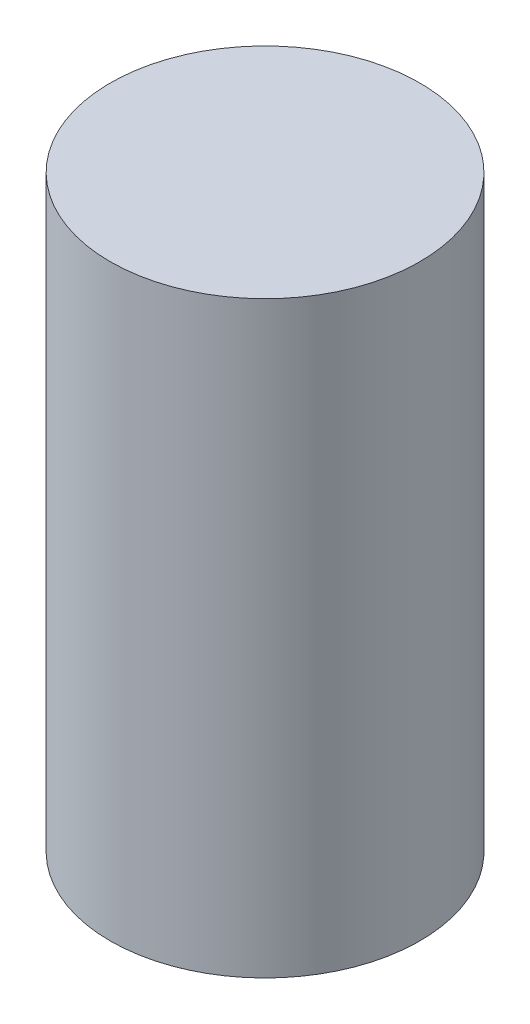
ISO-10303-21;
HEADER;
FILE_DESCRIPTION(('STEP AP214'),'2;1');
FILE_NAME('part.step','',(''),(''),'','','');
FILE_SCHEMA(('AUTOMOTIVE_DESIGN { 1 0 10303 214 1 1 1 1 }'));
ENDSEC;
DATA;
#1=APPLICATION_CONTEXT('core data for automotive mechanical design processes');
#2=APPLICATION_PROTOCOL_DEFINITION('international standard','automotive_design',2000,#1);
#3=PRODUCT_CONTEXT('',#1,'mechanical');
#4=PRODUCT('Part','Part','',(#3));
#5=PRODUCT_RELATED_PRODUCT_CATEGORY('part','',(#4));
#6=PRODUCT_DEFINITION_FORMATION('','',#4);
#7=PRODUCT_DEFINITION_CONTEXT('part definition',#1,'design');
#8=PRODUCT_DEFINITION('design','',#6,#7);
#9=PRODUCT_DEFINITION_SHAPE('','',#8);
#10=(LENGTH_UNIT() NAMED_UNIT(*) SI_UNIT(.MILLI.,.METRE.));
#11=(NAMED_UNIT(*) PLANE_ANGLE_UNIT() SI_UNIT($,.RADIAN.));
#12=(NAMED_UNIT(*) SI_UNIT($,.STERADIAN.) SOLID_ANGLE_UNIT());
#13=UNCERTAINTY_MEASURE_WITH_UNIT(LENGTH_MEASURE(1.E-05),#10,'distance_accuracy_value','');
#14=(GEOMETRIC_REPRESENTATION_CONTEXT(3) GLOBAL_UNCERTAINTY_ASSIGNED_CONTEXT((#13)) GLOBAL_UNIT_ASSIGNED_CONTEXT((#10,
#11,#12)) REPRESENTATION_CONTEXT('',''));
#15=CARTESIAN_POINT('',(0.,0.,0.));
#16=DIRECTION('',(0.,0.,1.));
#17=DIRECTION('',(1.,0.,0.));
#18=AXIS2_PLACEMENT_3D('',#15,#16,#17);
#19=CARTESIAN_POINT('',(0.,19.,0.));
#20=DIRECTION('',(0.,-1.,0.));
#21=DIRECTION('',(0.,0.,-1.));
#22=AXIS2_PLACEMENT_3D('',#19,#20,#21);
#23=CYLINDRICAL_SURFACE('',#22,5.);
#24=CARTESIAN_POINT('',(0.,19.,0.));
#25=DIRECTION('',(0.,1.,0.));
#26=DIRECTION('',(0.,0.,1.));
#27=AXIS2_PLACEMENT_3D('',#24,#25,#26);
#28=CIRCLE('',#27,5.);
#29=CARTESIAN_POINT('',(0.,19.,5.));
#30=VERTEX_POINT('',#29);
#31=EDGE_CURVE('E10',#30,#30,#28,.T.);
#32=ORIENTED_EDGE('',*,*,#31,.F.);
#33=EDGE_LOOP('',(#32));
#34=FACE_BOUND('',#33,.T.);
#35=CARTESIAN_POINT('',(0.,0.,0.));
#36=DIRECTION('',(0.,1.,0.));
#37=DIRECTION('',(0.,0.,1.));
#38=AXIS2_PLACEMENT_3D('',#35,#36,#37);
#39=CIRCLE('',#38,5.);
#40=CARTESIAN_POINT('',(0.,0.,5.));
#41=VERTEX_POINT('',#40);
#42=EDGE_CURVE('E40',#41,#41,#39,.T.);
#43=ORIENTED_EDGE('',*,*,#42,.T.);
#44=EDGE_LOOP('',(#43));
#45=FACE_BOUND('',#44,.T.);
#46=ADVANCED_FACE('F37',(#34,#45),#23,.T.);
#47=CARTESIAN_POINT('',(0.,19.,0.));
#48=DIRECTION('',(0.,1.,0.));
#49=DIRECTION('',(0.,0.,1.));
#50=AXIS2_PLACEMENT_3D('',#47,#48,#49);
#51=PLANE('',#50);
#52=ORIENTED_EDGE('',*,*,#31,.T.);
#53=EDGE_LOOP('',(#52));
#54=FACE_BOUND('',#53,.T.);
#55=ADVANCED_FACE('F54',(#54),#51,.T.);
#56=CARTESIAN_POINT('',(0.,0.,0.));
#57=DIRECTION('',(0.,1.,0.));
#58=DIRECTION('',(0.,0.,1.));
#59=AXIS2_PLACEMENT_3D('',#56,#57,#58);
#60=PLANE('',#59);
#61=ORIENTED_EDGE('',*,*,#42,.F.);
#62=EDGE_LOOP('',(#61));
#63=FACE_BOUND('',#62,.T.);
#64=ADVANCED_FACE('F52',(#63),#60,.F.);
#65=CLOSED_SHELL('',(#46,#55,#64));
#66=MANIFOLD_SOLID_BREP('B2',#65);
#67=ADVANCED_BREP_SHAPE_REPRESENTATION('',(#18,#66),#14);
#68=SHAPE_DEFINITION_REPRESENTATION(#9,#67);
ENDSEC;
END-ISO-10303-21;
